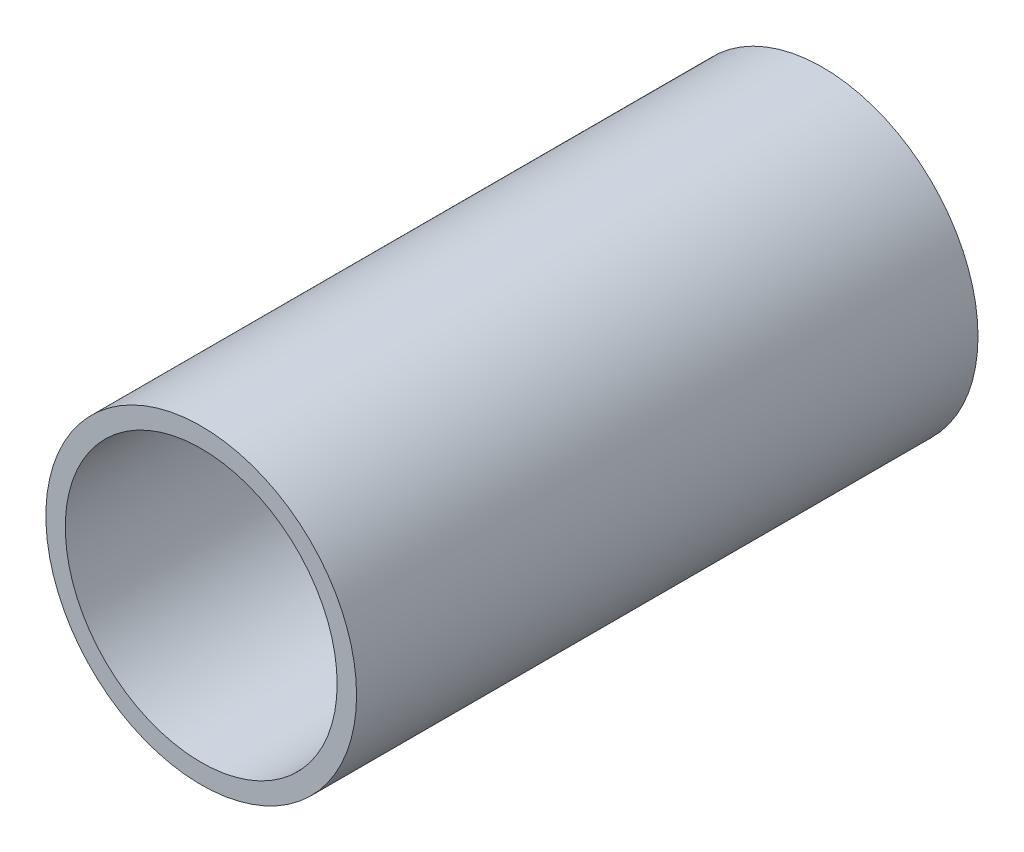
ISO-10303-21;
HEADER;
FILE_DESCRIPTION(('STEP AP214'),'2;1');
FILE_NAME('part.step','',(''),(''),'','','');
FILE_SCHEMA(('AUTOMOTIVE_DESIGN { 1 0 10303 214 1 1 1 1 }'));
ENDSEC;
DATA;
#1=APPLICATION_CONTEXT('core data for automotive mechanical design processes');
#2=APPLICATION_PROTOCOL_DEFINITION('international standard','automotive_design',2000,#1);
#3=PRODUCT_CONTEXT('',#1,'mechanical');
#4=PRODUCT('Part','Part','',(#3));
#5=PRODUCT_RELATED_PRODUCT_CATEGORY('part','',(#4));
#6=PRODUCT_DEFINITION_FORMATION('','',#4);
#7=PRODUCT_DEFINITION_CONTEXT('part definition',#1,'design');
#8=PRODUCT_DEFINITION('design','',#6,#7);
#9=PRODUCT_DEFINITION_SHAPE('','',#8);
#10=(LENGTH_UNIT() NAMED_UNIT(*) SI_UNIT(.MILLI.,.METRE.));
#11=(NAMED_UNIT(*) PLANE_ANGLE_UNIT() SI_UNIT($,.RADIAN.));
#12=(NAMED_UNIT(*) SI_UNIT($,.STERADIAN.) SOLID_ANGLE_UNIT());
#13=UNCERTAINTY_MEASURE_WITH_UNIT(LENGTH_MEASURE(1.E-05),#10,'distance_accuracy_value','');
#14=(GEOMETRIC_REPRESENTATION_CONTEXT(3) GLOBAL_UNCERTAINTY_ASSIGNED_CONTEXT((#13)) GLOBAL_UNIT_ASSIGNED_CONTEXT((#10,
#11,#12)) REPRESENTATION_CONTEXT('',''));
#15=CARTESIAN_POINT('',(0.,0.,0.));
#16=DIRECTION('',(0.,0.,1.));
#17=DIRECTION('',(1.,0.,0.));
#18=AXIS2_PLACEMENT_3D('',#15,#16,#17);
#19=CARTESIAN_POINT('',(0.,0.,25.4));
#20=DIRECTION('',(0.,0.,1.));
#21=DIRECTION('',(1.,0.,0.));
#22=AXIS2_PLACEMENT_3D('',#19,#20,#21);
#23=PLANE('',#22);
#24=CARTESIAN_POINT('',(0.,0.,25.4));
#25=DIRECTION('',(0.,0.,1.));
#26=DIRECTION('',(1.,0.,0.));
#27=AXIS2_PLACEMENT_3D('',#24,#25,#26);
#28=CIRCLE('',#27,6.35);
#29=CARTESIAN_POINT('',(6.35,0.,25.4));
#30=VERTEX_POINT('',#29);
#31=EDGE_CURVE('E10',#30,#30,#28,.T.);
#32=ORIENTED_EDGE('',*,*,#31,.T.);
#33=EDGE_LOOP('',(#32));
#34=FACE_BOUND('',#33,.T.);
#35=CARTESIAN_POINT('',(0.,0.,25.4));
#36=DIRECTION('',(0.,0.,1.));
#37=DIRECTION('',(1.,0.,0.));
#38=AXIS2_PLACEMENT_3D('',#35,#36,#37);
#39=CIRCLE('',#38,5.55625);
#40=CARTESIAN_POINT('',(5.55625,0.,25.4));
#41=VERTEX_POINT('',#40);
#42=EDGE_CURVE('E43',#41,#41,#39,.T.);
#43=ORIENTED_EDGE('',*,*,#42,.F.);
#44=EDGE_LOOP('',(#43));
#45=FACE_BOUND('',#44,.T.);
#46=ADVANCED_FACE('F32',(#34,#45),#23,.T.);
#47=CARTESIAN_POINT('',(0.,0.,0.));
#48=DIRECTION('',(0.,0.,1.));
#49=DIRECTION('',(1.,0.,0.));
#50=AXIS2_PLACEMENT_3D('',#47,#48,#49);
#51=PLANE('',#50);
#52=CARTESIAN_POINT('',(0.,0.,0.));
#53=DIRECTION('',(0.,0.,1.));
#54=DIRECTION('',(1.,0.,0.));
#55=AXIS2_PLACEMENT_3D('',#52,#53,#54);
#56=CIRCLE('',#55,6.35);
#57=CARTESIAN_POINT('',(6.35,0.,0.));
#58=VERTEX_POINT('',#57);
#59=EDGE_CURVE('E36',#58,#58,#56,.T.);
#60=ORIENTED_EDGE('',*,*,#59,.F.);
#61=EDGE_LOOP('',(#60));
#62=FACE_BOUND('',#61,.T.);
#63=CARTESIAN_POINT('',(0.,0.,0.));
#64=DIRECTION('',(0.,0.,1.));
#65=DIRECTION('',(1.,0.,0.));
#66=AXIS2_PLACEMENT_3D('',#63,#64,#65);
#67=CIRCLE('',#66,5.55625);
#68=CARTESIAN_POINT('',(5.55625,0.,0.));
#69=VERTEX_POINT('',#68);
#70=EDGE_CURVE('E45',#69,#69,#67,.T.);
#71=ORIENTED_EDGE('',*,*,#70,.T.);
#72=EDGE_LOOP('',(#71));
#73=FACE_BOUND('',#72,.T.);
#74=ADVANCED_FACE('F55',(#62,#73),#51,.F.);
#75=CARTESIAN_POINT('',(0.,0.,25.4));
#76=DIRECTION('',(0.,0.,-1.));
#77=DIRECTION('',(-1.,0.,0.));
#78=AXIS2_PLACEMENT_3D('',#75,#76,#77);
#79=CYLINDRICAL_SURFACE('',#78,6.35);
#80=ORIENTED_EDGE('',*,*,#31,.F.);
#81=EDGE_LOOP('',(#80));
#82=FACE_BOUND('',#81,.T.);
#83=ORIENTED_EDGE('',*,*,#59,.T.);
#84=EDGE_LOOP('',(#83));
#85=FACE_BOUND('',#84,.T.);
#86=ADVANCED_FACE('F34',(#82,#85),#79,.T.);
#87=CARTESIAN_POINT('',(0.,0.,25.4));
#88=DIRECTION('',(0.,0.,-1.));
#89=DIRECTION('',(-1.,0.,0.));
#90=AXIS2_PLACEMENT_3D('',#87,#88,#89);
#91=CYLINDRICAL_SURFACE('',#90,5.55625);
#92=ORIENTED_EDGE('',*,*,#42,.T.);
#93=EDGE_LOOP('',(#92));
#94=FACE_BOUND('',#93,.T.);
#95=ORIENTED_EDGE('',*,*,#70,.F.);
#96=EDGE_LOOP('',(#95));
#97=FACE_BOUND('',#96,.T.);
#98=ADVANCED_FACE('F51',(#94,#97),#91,.F.);
#99=CLOSED_SHELL('',(#46,#74,#86,#98));
#100=MANIFOLD_SOLID_BREP('B2',#99);
#101=ADVANCED_BREP_SHAPE_REPRESENTATION('',(#18,#100),#14);
#102=SHAPE_DEFINITION_REPRESENTATION(#9,#101);
ENDSEC;
END-ISO-10303-21;
